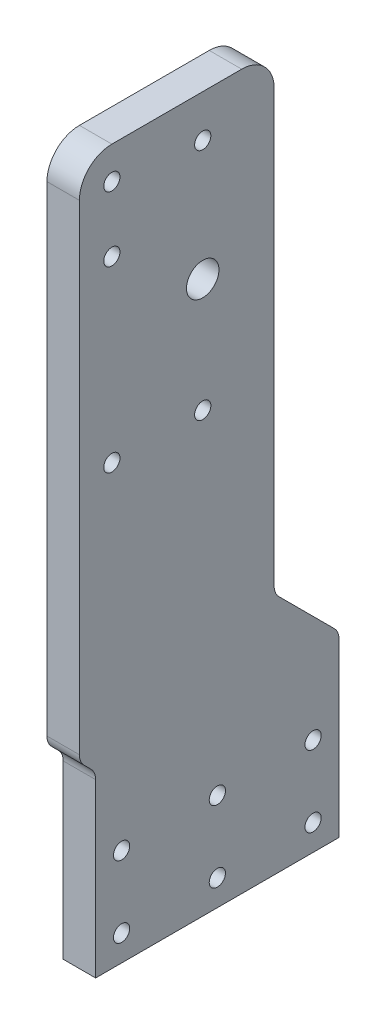
ISO-10303-21;
HEADER;
FILE_DESCRIPTION(('STEP AP214'),'2;1');
FILE_NAME('part.step','',(''),(''),'','','');
FILE_SCHEMA(('AUTOMOTIVE_DESIGN { 1 0 10303 214 1 1 1 1 }'));
ENDSEC;
DATA;
#1=APPLICATION_CONTEXT('core data for automotive mechanical design processes');
#2=APPLICATION_PROTOCOL_DEFINITION('international standard','automotive_design',2000,#1);
#3=PRODUCT_CONTEXT('',#1,'mechanical');
#4=PRODUCT('Part','Part','',(#3));
#5=PRODUCT_RELATED_PRODUCT_CATEGORY('part','',(#4));
#6=PRODUCT_DEFINITION_FORMATION('','',#4);
#7=PRODUCT_DEFINITION_CONTEXT('part definition',#1,'design');
#8=PRODUCT_DEFINITION('design','',#6,#7);
#9=PRODUCT_DEFINITION_SHAPE('','',#8);
#10=(LENGTH_UNIT() NAMED_UNIT(*) SI_UNIT(.MILLI.,.METRE.));
#11=(NAMED_UNIT(*) PLANE_ANGLE_UNIT() SI_UNIT($,.RADIAN.));
#12=(NAMED_UNIT(*) SI_UNIT($,.STERADIAN.) SOLID_ANGLE_UNIT());
#13=UNCERTAINTY_MEASURE_WITH_UNIT(LENGTH_MEASURE(1.E-05),#10,'distance_accuracy_value','');
#14=(GEOMETRIC_REPRESENTATION_CONTEXT(3) GLOBAL_UNCERTAINTY_ASSIGNED_CONTEXT((#13)) GLOBAL_UNIT_ASSIGNED_CONTEXT((#10,
#11,#12)) REPRESENTATION_CONTEXT('',''));
#15=CARTESIAN_POINT('',(0.,0.,0.));
#16=DIRECTION('',(0.,0.,1.));
#17=DIRECTION('',(1.,0.,0.));
#18=AXIS2_PLACEMENT_3D('',#15,#16,#17);
#19=CARTESIAN_POINT('',(10.,52.9289321881345,-70.));
#20=DIRECTION('',(1.,0.,0.));
#21=DIRECTION('',(0.,0.,-1.));
#22=AXIS2_PLACEMENT_3D('',#19,#20,#21);
#23=PLANE('',#22);
#24=CARTESIAN_POINT('',(10.,8.,-67.));
#25=DIRECTION('',(1.,0.,0.));
#26=DIRECTION('',(0.,0.,-1.));
#27=AXIS2_PLACEMENT_3D('',#24,#25,#26);
#28=CIRCLE('',#27,2.5);
#29=CARTESIAN_POINT('',(10.,8.,-69.5));
#30=VERTEX_POINT('',#29);
#31=EDGE_CURVE('E396',#30,#30,#28,.T.);
#32=ORIENTED_EDGE('',*,*,#31,.F.);
#33=EDGE_LOOP('',(#32));
#34=FACE_BOUND('',#33,.T.);
#35=CARTESIAN_POINT('',(10.,30.,-37.5));
#36=DIRECTION('',(1.,0.,0.));
#37=DIRECTION('',(0.,0.,-1.));
#38=AXIS2_PLACEMENT_3D('',#35,#36,#37);
#39=CIRCLE('',#38,2.5);
#40=CARTESIAN_POINT('',(10.,30.,-40.));
#41=VERTEX_POINT('',#40);
#42=EDGE_CURVE('E412',#41,#41,#39,.T.);
#43=ORIENTED_EDGE('',*,*,#42,.F.);
#44=EDGE_LOOP('',(#43));
#45=FACE_BOUND('',#44,.T.);
#46=CARTESIAN_POINT('',(10.,8.,-8.));
#47=DIRECTION('',(1.,0.,0.));
#48=DIRECTION('',(0.,0.,-1.));
#49=AXIS2_PLACEMENT_3D('',#46,#47,#48);
#50=CIRCLE('',#49,2.5);
#51=CARTESIAN_POINT('',(10.,8.,-10.5));
#52=VERTEX_POINT('',#51);
#53=EDGE_CURVE('E428',#52,#52,#50,.T.);
#54=ORIENTED_EDGE('',*,*,#53,.F.);
#55=EDGE_LOOP('',(#54));
#56=FACE_BOUND('',#55,.T.);
#57=CARTESIAN_POINT('',(10.,135.,-33.));
#58=DIRECTION('',(1.,0.,0.));
#59=DIRECTION('',(0.,0.,-1.));
#60=AXIS2_PLACEMENT_3D('',#57,#58,#59);
#61=CIRCLE('',#60,2.5);
#62=CARTESIAN_POINT('',(10.,135.,-35.5));
#63=VERTEX_POINT('',#62);
#64=EDGE_CURVE('E444',#63,#63,#61,.T.);
#65=ORIENTED_EDGE('',*,*,#64,.F.);
#66=EDGE_LOOP('',(#65));
#67=FACE_BOUND('',#66,.T.);
#68=CARTESIAN_POINT('',(10.,207.,-33.));
#69=DIRECTION('',(1.,0.,0.));
#70=DIRECTION('',(0.,0.,-1.));
#71=AXIS2_PLACEMENT_3D('',#68,#69,#70);
#72=CIRCLE('',#71,2.5);
#73=CARTESIAN_POINT('',(10.,207.,-35.5));
#74=VERTEX_POINT('',#73);
#75=EDGE_CURVE('E460',#74,#74,#72,.T.);
#76=ORIENTED_EDGE('',*,*,#75,.F.);
#77=EDGE_LOOP('',(#76));
#78=FACE_BOUND('',#77,.T.);
#79=CARTESIAN_POINT('',(10.,210.,-4.99999999999998));
#80=DIRECTION('',(1.,0.,0.));
#81=DIRECTION('',(0.,0.,-1.));
#82=AXIS2_PLACEMENT_3D('',#79,#80,#81);
#83=CIRCLE('',#82,2.5);
#84=CARTESIAN_POINT('',(10.,210.,-7.49999999999998));
#85=VERTEX_POINT('',#84);
#86=EDGE_CURVE('E182',#85,#85,#83,.T.);
#87=ORIENTED_EDGE('',*,*,#86,.F.);
#88=EDGE_LOOP('',(#87));
#89=FACE_BOUND('',#88,.T.);
#90=DIRECTION('',(0.,-1.,0.));
#91=VECTOR('',#90,1.);
#92=CARTESIAN_POINT('',(10.,52.9289321881345,0.));
#93=LINE('',#92,#91);
#94=CARTESIAN_POINT('',(10.,52.9289321881345,0.));
#95=VERTEX_POINT('',#94);
#96=CARTESIAN_POINT('',(10.,0.,0.));
#97=VERTEX_POINT('',#96);
#98=EDGE_CURVE('E218',#95,#97,#93,.T.);
#99=ORIENTED_EDGE('',*,*,#98,.T.);
#100=DIRECTION('',(0.,0.,-1.));
#101=VECTOR('',#100,1.);
#102=CARTESIAN_POINT('',(10.,0.,0.));
#103=LINE('',#102,#101);
#104=CARTESIAN_POINT('',(10.,0.,-75.));
#105=VERTEX_POINT('',#104);
#106=EDGE_CURVE('E118',#97,#105,#103,.T.);
#107=ORIENTED_EDGE('',*,*,#106,.T.);
#108=DIRECTION('',(0.,1.,0.));
#109=VECTOR('',#108,1.);
#110=CARTESIAN_POINT('',(10.,0.,-75.));
#111=LINE('',#110,#109);
#112=CARTESIAN_POINT('',(10.,52.9289321881345,-75.));
#113=VERTEX_POINT('',#112);
#114=EDGE_CURVE('E263',#105,#113,#111,.T.);
#115=ORIENTED_EDGE('',*,*,#114,.T.);
#116=CARTESIAN_POINT('',(10.,52.9289321881345,-70.));
#117=DIRECTION('',(1.,0.,0.));
#118=DIRECTION('',(0.,0.,-1.));
#119=AXIS2_PLACEMENT_3D('',#116,#117,#118);
#120=CIRCLE('',#119,5.00000000000001);
#121=CARTESIAN_POINT('',(10.,56.4644660940673,-73.5355339059327));
#122=VERTEX_POINT('',#121);
#123=EDGE_CURVE('E283',#113,#122,#120,.T.);
#124=ORIENTED_EDGE('',*,*,#123,.T.);
#125=DIRECTION('',(0.,0.707106781186547,0.707106781186548));
#126=VECTOR('',#125,1.);
#127=CARTESIAN_POINT('',(10.,56.4644660940673,-73.5355339059327));
#128=LINE('',#127,#126);
#129=CARTESIAN_POINT('',(10.,73.5355339059327,-56.4644660940673));
#130=VERTEX_POINT('',#129);
#131=EDGE_CURVE('E279',#122,#130,#128,.T.);
#132=ORIENTED_EDGE('',*,*,#131,.T.);
#133=CARTESIAN_POINT('',(10.,77.0710678118655,-60.));
#134=DIRECTION('',(-1.,0.,0.));
#135=DIRECTION('',(0.,0.,1.));
#136=AXIS2_PLACEMENT_3D('',#133,#134,#135);
#137=CIRCLE('',#136,5.);
#138=CARTESIAN_POINT('',(10.,77.0710678118655,-55.));
#139=VERTEX_POINT('',#138);
#140=EDGE_CURVE('E282',#130,#139,#137,.T.);
#141=ORIENTED_EDGE('',*,*,#140,.T.);
#142=DIRECTION('',(0.,1.,0.));
#143=VECTOR('',#142,1.);
#144=CARTESIAN_POINT('',(10.,77.0710678118655,-55.));
#145=LINE('',#144,#143);
#146=CARTESIAN_POINT('',(10.,210.,-55.));
#147=VERTEX_POINT('',#146);
#148=EDGE_CURVE('E287',#139,#147,#145,.T.);
#149=ORIENTED_EDGE('',*,*,#148,.T.);
#150=CARTESIAN_POINT('',(10.,210.,-45.));
#151=DIRECTION('',(1.,0.,0.));
#152=DIRECTION('',(0.,0.,-1.));
#153=AXIS2_PLACEMENT_3D('',#150,#151,#152);
#154=CIRCLE('',#153,10.);
#155=CARTESIAN_POINT('',(10.,220.,-44.9999999999999));
#156=VERTEX_POINT('',#155);
#157=EDGE_CURVE('E294',#147,#156,#154,.T.);
#158=ORIENTED_EDGE('',*,*,#157,.T.);
#159=DIRECTION('',(0.,0.,1.));
#160=VECTOR('',#159,1.);
#161=CARTESIAN_POINT('',(10.,220.,-44.9999999999999));
#162=LINE('',#161,#160);
#163=CARTESIAN_POINT('',(10.,220.,-5.00000000000005));
#164=VERTEX_POINT('',#163);
#165=EDGE_CURVE('E297',#156,#164,#162,.T.);
#166=ORIENTED_EDGE('',*,*,#165,.T.);
#167=CARTESIAN_POINT('',(10.,210.,-4.99999999999998));
#168=DIRECTION('',(1.,0.,0.));
#169=DIRECTION('',(0.,0.,-1.));
#170=AXIS2_PLACEMENT_3D('',#167,#168,#169);
#171=CIRCLE('',#170,10.);
#172=CARTESIAN_POINT('',(10.,210.,5.00000000000003));
#173=VERTEX_POINT('',#172);
#174=EDGE_CURVE('E300',#164,#173,#171,.T.);
#175=ORIENTED_EDGE('',*,*,#174,.T.);
#176=DIRECTION('',(0.,-1.,0.));
#177=VECTOR('',#176,1.);
#178=CARTESIAN_POINT('',(10.,210.,5.00000000000002));
#179=LINE('',#178,#177);
#180=CARTESIAN_POINT('',(10.,62.0710678118655,5.));
#181=VERTEX_POINT('',#180);
#182=EDGE_CURVE('E155',#173,#181,#179,.T.);
#183=ORIENTED_EDGE('',*,*,#182,.T.);
#184=CARTESIAN_POINT('',(10.,62.0710678118655,0.));
#185=DIRECTION('',(1.,0.,0.));
#186=DIRECTION('',(0.,0.,1.));
#187=AXIS2_PLACEMENT_3D('',#184,#185,#186);
#188=CIRCLE('',#187,5.);
#189=CARTESIAN_POINT('',(10.,58.5355339059327,3.53553390593272));
#190=VERTEX_POINT('',#189);
#191=EDGE_CURVE('E149',#181,#190,#188,.T.);
#192=ORIENTED_EDGE('',*,*,#191,.T.);
#193=DIRECTION('',(0.,-0.707106781186547,-0.707106781186548));
#194=VECTOR('',#193,1.);
#195=CARTESIAN_POINT('',(10.,58.5355339059327,3.53553390593272));
#196=LINE('',#195,#194);
#197=CARTESIAN_POINT('',(10.,56.4644660940673,1.46446609406728));
#198=VERTEX_POINT('',#197);
#199=EDGE_CURVE('E153',#190,#198,#196,.T.);
#200=ORIENTED_EDGE('',*,*,#199,.T.);
#201=CARTESIAN_POINT('',(10.,52.9289321881345,5.));
#202=DIRECTION('',(-1.,0.,0.));
#203=DIRECTION('',(0.,0.,-1.));
#204=AXIS2_PLACEMENT_3D('',#201,#202,#203);
#205=CIRCLE('',#204,5.);
#206=EDGE_CURVE('E57',#198,#95,#205,.T.);
#207=ORIENTED_EDGE('',*,*,#206,.T.);
#208=EDGE_LOOP('',(#99,#107,#115,#124,#132,#141,#149,#158,#166,#175,#183,#192,#200,#207));
#209=FACE_BOUND('',#208,.T.);
#210=CARTESIAN_POINT('',(10.,190.,-4.99999999999998));
#211=DIRECTION('',(1.,0.,0.));
#212=DIRECTION('',(0.,0.,-1.));
#213=AXIS2_PLACEMENT_3D('',#210,#211,#212);
#214=CIRCLE('',#213,2.5);
#215=CARTESIAN_POINT('',(10.,190.,-7.49999999999998));
#216=VERTEX_POINT('',#215);
#217=EDGE_CURVE('E468',#216,#216,#214,.T.);
#218=ORIENTED_EDGE('',*,*,#217,.F.);
#219=EDGE_LOOP('',(#218));
#220=FACE_BOUND('',#219,.T.);
#221=CARTESIAN_POINT('',(10.,135.,-4.99999999999998));
#222=DIRECTION('',(1.,0.,0.));
#223=DIRECTION('',(0.,0.,-1.));
#224=AXIS2_PLACEMENT_3D('',#221,#222,#223);
#225=CIRCLE('',#224,2.5);
#226=CARTESIAN_POINT('',(10.,135.,-7.49999999999998));
#227=VERTEX_POINT('',#226);
#228=EDGE_CURVE('E452',#227,#227,#225,.T.);
#229=ORIENTED_EDGE('',*,*,#228,.F.);
#230=EDGE_LOOP('',(#229));
#231=FACE_BOUND('',#230,.T.);
#232=CARTESIAN_POINT('',(10.,30.,-8.));
#233=DIRECTION('',(1.,0.,0.));
#234=DIRECTION('',(0.,0.,-1.));
#235=AXIS2_PLACEMENT_3D('',#232,#233,#234);
#236=CIRCLE('',#235,2.5);
#237=CARTESIAN_POINT('',(10.,30.,-10.5));
#238=VERTEX_POINT('',#237);
#239=EDGE_CURVE('E436',#238,#238,#236,.T.);
#240=ORIENTED_EDGE('',*,*,#239,.F.);
#241=EDGE_LOOP('',(#240));
#242=FACE_BOUND('',#241,.T.);
#243=CARTESIAN_POINT('',(10.,8.,-37.5));
#244=DIRECTION('',(1.,0.,0.));
#245=DIRECTION('',(0.,0.,-1.));
#246=AXIS2_PLACEMENT_3D('',#243,#244,#245);
#247=CIRCLE('',#246,2.5);
#248=CARTESIAN_POINT('',(10.,8.,-40.));
#249=VERTEX_POINT('',#248);
#250=EDGE_CURVE('E420',#249,#249,#247,.T.);
#251=ORIENTED_EDGE('',*,*,#250,.F.);
#252=EDGE_LOOP('',(#251));
#253=FACE_BOUND('',#252,.T.);
#254=CARTESIAN_POINT('',(10.,30.,-67.));
#255=DIRECTION('',(1.,0.,0.));
#256=DIRECTION('',(0.,0.,-1.));
#257=AXIS2_PLACEMENT_3D('',#254,#255,#256);
#258=CIRCLE('',#257,2.5);
#259=CARTESIAN_POINT('',(10.,30.,-69.5));
#260=VERTEX_POINT('',#259);
#261=EDGE_CURVE('E404',#260,#260,#258,.T.);
#262=ORIENTED_EDGE('',*,*,#261,.F.);
#263=EDGE_LOOP('',(#262));
#264=FACE_BOUND('',#263,.T.);
#265=CARTESIAN_POINT('',(10.,170.,-33.));
#266=DIRECTION('',(1.,0.,0.));
#267=DIRECTION('',(0.,0.,-1.));
#268=AXIS2_PLACEMENT_3D('',#265,#266,#267);
#269=CIRCLE('',#268,5.);
#270=CARTESIAN_POINT('',(10.,170.,-38.));
#271=VERTEX_POINT('',#270);
#272=EDGE_CURVE('E385',#271,#271,#269,.T.);
#273=ORIENTED_EDGE('',*,*,#272,.F.);
#274=EDGE_LOOP('',(#273));
#275=FACE_BOUND('',#274,.T.);
#276=ADVANCED_FACE('F39',(#34,#45,#56,#67,#78,#89,#209,#220,#231,#242,#253,#264,#275),#23,.T.);
#277=CARTESIAN_POINT('',(0.,52.9289321881345,-70.));
#278=DIRECTION('',(1.,0.,0.));
#279=DIRECTION('',(0.,0.,-1.));
#280=AXIS2_PLACEMENT_3D('',#277,#278,#279);
#281=PLANE('',#280);
#282=DIRECTION('',(0.,-1.,0.));
#283=VECTOR('',#282,1.);
#284=CARTESIAN_POINT('',(0.,52.9289321881345,0.));
#285=LINE('',#284,#283);
#286=CARTESIAN_POINT('',(0.,52.9289321881345,0.));
#287=VERTEX_POINT('',#286);
#288=CARTESIAN_POINT('',(0.,0.,0.));
#289=VERTEX_POINT('',#288);
#290=EDGE_CURVE('E177',#287,#289,#285,.T.);
#291=ORIENTED_EDGE('',*,*,#290,.F.);
#292=CARTESIAN_POINT('',(0.,52.9289321881345,5.));
#293=DIRECTION('',(-1.,0.,0.));
#294=DIRECTION('',(0.,0.,-1.));
#295=AXIS2_PLACEMENT_3D('',#292,#293,#294);
#296=CIRCLE('',#295,5.);
#297=CARTESIAN_POINT('',(0.,56.4644660940673,1.46446609406728));
#298=VERTEX_POINT('',#297);
#299=EDGE_CURVE('E110',#298,#287,#296,.T.);
#300=ORIENTED_EDGE('',*,*,#299,.F.);
#301=DIRECTION('',(0.,-0.707106781186547,-0.707106781186548));
#302=VECTOR('',#301,1.);
#303=CARTESIAN_POINT('',(0.,58.5355339059327,3.53553390593272));
#304=LINE('',#303,#302);
#305=CARTESIAN_POINT('',(0.,58.5355339059327,3.53553390593272));
#306=VERTEX_POINT('',#305);
#307=EDGE_CURVE('E104',#306,#298,#304,.T.);
#308=ORIENTED_EDGE('',*,*,#307,.F.);
#309=CARTESIAN_POINT('',(0.,62.0710678118655,0.));
#310=DIRECTION('',(1.,0.,0.));
#311=DIRECTION('',(0.,0.,1.));
#312=AXIS2_PLACEMENT_3D('',#309,#310,#311);
#313=CIRCLE('',#312,5.);
#314=CARTESIAN_POINT('',(0.,62.0710678118655,5.));
#315=VERTEX_POINT('',#314);
#316=EDGE_CURVE('E164',#315,#306,#313,.T.);
#317=ORIENTED_EDGE('',*,*,#316,.F.);
#318=DIRECTION('',(0.,-1.,0.));
#319=VECTOR('',#318,1.);
#320=CARTESIAN_POINT('',(0.,210.,5.00000000000002));
#321=LINE('',#320,#319);
#322=CARTESIAN_POINT('',(0.,210.,5.00000000000003));
#323=VERTEX_POINT('',#322);
#324=EDGE_CURVE('E209',#323,#315,#321,.T.);
#325=ORIENTED_EDGE('',*,*,#324,.F.);
#326=CARTESIAN_POINT('',(0.,210.,-4.99999999999998));
#327=DIRECTION('',(1.,0.,0.));
#328=DIRECTION('',(0.,0.,-1.));
#329=AXIS2_PLACEMENT_3D('',#326,#327,#328);
#330=CIRCLE('',#329,10.);
#331=CARTESIAN_POINT('',(0.,220.,-5.00000000000005));
#332=VERTEX_POINT('',#331);
#333=EDGE_CURVE('E206',#332,#323,#330,.T.);
#334=ORIENTED_EDGE('',*,*,#333,.F.);
#335=DIRECTION('',(0.,0.,1.));
#336=VECTOR('',#335,1.);
#337=CARTESIAN_POINT('',(0.,220.,-44.9999999999999));
#338=LINE('',#337,#336);
#339=CARTESIAN_POINT('',(0.,220.,-44.9999999999999));
#340=VERTEX_POINT('',#339);
#341=EDGE_CURVE('E203',#340,#332,#338,.T.);
#342=ORIENTED_EDGE('',*,*,#341,.F.);
#343=CARTESIAN_POINT('',(0.,210.,-45.));
#344=DIRECTION('',(1.,0.,0.));
#345=DIRECTION('',(0.,0.,-1.));
#346=AXIS2_PLACEMENT_3D('',#343,#344,#345);
#347=CIRCLE('',#346,10.);
#348=CARTESIAN_POINT('',(0.,210.,-55.));
#349=VERTEX_POINT('',#348);
#350=EDGE_CURVE('E200',#349,#340,#347,.T.);
#351=ORIENTED_EDGE('',*,*,#350,.F.);
#352=DIRECTION('',(0.,1.,0.));
#353=VECTOR('',#352,1.);
#354=CARTESIAN_POINT('',(0.,77.0710678118655,-55.));
#355=LINE('',#354,#353);
#356=CARTESIAN_POINT('',(0.,77.0710678118655,-55.));
#357=VERTEX_POINT('',#356);
#358=EDGE_CURVE('E197',#357,#349,#355,.T.);
#359=ORIENTED_EDGE('',*,*,#358,.F.);
#360=CARTESIAN_POINT('',(0.,77.0710678118655,-60.));
#361=DIRECTION('',(-1.,0.,0.));
#362=DIRECTION('',(0.,0.,1.));
#363=AXIS2_PLACEMENT_3D('',#360,#361,#362);
#364=CIRCLE('',#363,5.);
#365=CARTESIAN_POINT('',(0.,73.5355339059327,-56.4644660940673));
#366=VERTEX_POINT('',#365);
#367=EDGE_CURVE('E194',#366,#357,#364,.T.);
#368=ORIENTED_EDGE('',*,*,#367,.F.);
#369=DIRECTION('',(0.,0.707106781186547,0.707106781186548));
#370=VECTOR('',#369,1.);
#371=CARTESIAN_POINT('',(0.,56.4644660940673,-73.5355339059327));
#372=LINE('',#371,#370);
#373=CARTESIAN_POINT('',(0.,56.4644660940673,-73.5355339059327));
#374=VERTEX_POINT('',#373);
#375=EDGE_CURVE('E191',#374,#366,#372,.T.);
#376=ORIENTED_EDGE('',*,*,#375,.F.);
#377=CARTESIAN_POINT('',(0.,52.9289321881345,-70.));
#378=DIRECTION('',(1.,0.,0.));
#379=DIRECTION('',(0.,0.,-1.));
#380=AXIS2_PLACEMENT_3D('',#377,#378,#379);
#381=CIRCLE('',#380,5.00000000000001);
#382=CARTESIAN_POINT('',(0.,52.9289321881345,-75.));
#383=VERTEX_POINT('',#382);
#384=EDGE_CURVE('E188',#383,#374,#381,.T.);
#385=ORIENTED_EDGE('',*,*,#384,.F.);
#386=DIRECTION('',(0.,1.,0.));
#387=VECTOR('',#386,1.);
#388=CARTESIAN_POINT('',(0.,0.,-75.));
#389=LINE('',#388,#387);
#390=CARTESIAN_POINT('',(0.,0.,-75.));
#391=VERTEX_POINT('',#390);
#392=EDGE_CURVE('E185',#391,#383,#389,.T.);
#393=ORIENTED_EDGE('',*,*,#392,.F.);
#394=DIRECTION('',(0.,0.,-1.));
#395=VECTOR('',#394,1.);
#396=CARTESIAN_POINT('',(0.,0.,0.));
#397=LINE('',#396,#395);
#398=EDGE_CURVE('E181',#289,#391,#397,.T.);
#399=ORIENTED_EDGE('',*,*,#398,.F.);
#400=EDGE_LOOP('',(#291,#300,#308,#317,#325,#334,#342,#351,#359,#368,#376,#385,#393,#399));
#401=FACE_BOUND('',#400,.T.);
#402=CARTESIAN_POINT('',(0.,210.,-4.99999999999998));
#403=DIRECTION('',(1.,0.,0.));
#404=DIRECTION('',(0.,0.,-1.));
#405=AXIS2_PLACEMENT_3D('',#402,#403,#404);
#406=CIRCLE('',#405,2.5);
#407=CARTESIAN_POINT('',(0.,210.,-7.49999999999998));
#408=VERTEX_POINT('',#407);
#409=EDGE_CURVE('E472',#408,#408,#406,.T.);
#410=ORIENTED_EDGE('',*,*,#409,.T.);
#411=EDGE_LOOP('',(#410));
#412=FACE_BOUND('',#411,.T.);
#413=CARTESIAN_POINT('',(0.,190.,-4.99999999999998));
#414=DIRECTION('',(1.,0.,0.));
#415=DIRECTION('',(0.,0.,-1.));
#416=AXIS2_PLACEMENT_3D('',#413,#414,#415);
#417=CIRCLE('',#416,2.5);
#418=CARTESIAN_POINT('',(0.,190.,-7.49999999999998));
#419=VERTEX_POINT('',#418);
#420=EDGE_CURVE('E464',#419,#419,#417,.T.);
#421=ORIENTED_EDGE('',*,*,#420,.T.);
#422=EDGE_LOOP('',(#421));
#423=FACE_BOUND('',#422,.T.);
#424=CARTESIAN_POINT('',(0.,207.,-33.));
#425=DIRECTION('',(1.,0.,0.));
#426=DIRECTION('',(0.,0.,-1.));
#427=AXIS2_PLACEMENT_3D('',#424,#425,#426);
#428=CIRCLE('',#427,2.5);
#429=CARTESIAN_POINT('',(0.,207.,-35.5));
#430=VERTEX_POINT('',#429);
#431=EDGE_CURVE('E456',#430,#430,#428,.T.);
#432=ORIENTED_EDGE('',*,*,#431,.T.);
#433=EDGE_LOOP('',(#432));
#434=FACE_BOUND('',#433,.T.);
#435=CARTESIAN_POINT('',(0.,135.,-4.99999999999998));
#436=DIRECTION('',(1.,0.,0.));
#437=DIRECTION('',(0.,0.,-1.));
#438=AXIS2_PLACEMENT_3D('',#435,#436,#437);
#439=CIRCLE('',#438,2.5);
#440=CARTESIAN_POINT('',(0.,135.,-7.49999999999998));
#441=VERTEX_POINT('',#440);
#442=EDGE_CURVE('E448',#441,#441,#439,.T.);
#443=ORIENTED_EDGE('',*,*,#442,.T.);
#444=EDGE_LOOP('',(#443));
#445=FACE_BOUND('',#444,.T.);
#446=CARTESIAN_POINT('',(0.,135.,-33.));
#447=DIRECTION('',(1.,0.,0.));
#448=DIRECTION('',(0.,0.,-1.));
#449=AXIS2_PLACEMENT_3D('',#446,#447,#448);
#450=CIRCLE('',#449,2.5);
#451=CARTESIAN_POINT('',(0.,135.,-35.5));
#452=VERTEX_POINT('',#451);
#453=EDGE_CURVE('E440',#452,#452,#450,.T.);
#454=ORIENTED_EDGE('',*,*,#453,.T.);
#455=EDGE_LOOP('',(#454));
#456=FACE_BOUND('',#455,.T.);
#457=CARTESIAN_POINT('',(0.,30.,-8.));
#458=DIRECTION('',(1.,0.,0.));
#459=DIRECTION('',(0.,0.,-1.));
#460=AXIS2_PLACEMENT_3D('',#457,#458,#459);
#461=CIRCLE('',#460,2.5);
#462=CARTESIAN_POINT('',(0.,30.,-10.5));
#463=VERTEX_POINT('',#462);
#464=EDGE_CURVE('E432',#463,#463,#461,.T.);
#465=ORIENTED_EDGE('',*,*,#464,.T.);
#466=EDGE_LOOP('',(#465));
#467=FACE_BOUND('',#466,.T.);
#468=CARTESIAN_POINT('',(0.,8.,-8.));
#469=DIRECTION('',(1.,0.,0.));
#470=DIRECTION('',(0.,0.,-1.));
#471=AXIS2_PLACEMENT_3D('',#468,#469,#470);
#472=CIRCLE('',#471,2.5);
#473=CARTESIAN_POINT('',(0.,8.,-10.5));
#474=VERTEX_POINT('',#473);
#475=EDGE_CURVE('E424',#474,#474,#472,.T.);
#476=ORIENTED_EDGE('',*,*,#475,.T.);
#477=EDGE_LOOP('',(#476));
#478=FACE_BOUND('',#477,.T.);
#479=CARTESIAN_POINT('',(0.,8.,-37.5));
#480=DIRECTION('',(1.,0.,0.));
#481=DIRECTION('',(0.,0.,-1.));
#482=AXIS2_PLACEMENT_3D('',#479,#480,#481);
#483=CIRCLE('',#482,2.5);
#484=CARTESIAN_POINT('',(0.,8.,-40.));
#485=VERTEX_POINT('',#484);
#486=EDGE_CURVE('E416',#485,#485,#483,.T.);
#487=ORIENTED_EDGE('',*,*,#486,.T.);
#488=EDGE_LOOP('',(#487));
#489=FACE_BOUND('',#488,.T.);
#490=CARTESIAN_POINT('',(0.,30.,-37.5));
#491=DIRECTION('',(1.,0.,0.));
#492=DIRECTION('',(0.,0.,-1.));
#493=AXIS2_PLACEMENT_3D('',#490,#491,#492);
#494=CIRCLE('',#493,2.5);
#495=CARTESIAN_POINT('',(0.,30.,-40.));
#496=VERTEX_POINT('',#495);
#497=EDGE_CURVE('E408',#496,#496,#494,.T.);
#498=ORIENTED_EDGE('',*,*,#497,.T.);
#499=EDGE_LOOP('',(#498));
#500=FACE_BOUND('',#499,.T.);
#501=CARTESIAN_POINT('',(0.,30.,-67.));
#502=DIRECTION('',(1.,0.,0.));
#503=DIRECTION('',(0.,0.,-1.));
#504=AXIS2_PLACEMENT_3D('',#501,#502,#503);
#505=CIRCLE('',#504,2.5);
#506=CARTESIAN_POINT('',(0.,30.,-69.5));
#507=VERTEX_POINT('',#506);
#508=EDGE_CURVE('E400',#507,#507,#505,.T.);
#509=ORIENTED_EDGE('',*,*,#508,.T.);
#510=EDGE_LOOP('',(#509));
#511=FACE_BOUND('',#510,.T.);
#512=CARTESIAN_POINT('',(0.,8.,-67.));
#513=DIRECTION('',(1.,0.,0.));
#514=DIRECTION('',(0.,0.,-1.));
#515=AXIS2_PLACEMENT_3D('',#512,#513,#514);
#516=CIRCLE('',#515,2.5);
#517=CARTESIAN_POINT('',(0.,8.,-69.5));
#518=VERTEX_POINT('',#517);
#519=EDGE_CURVE('E393',#518,#518,#516,.T.);
#520=ORIENTED_EDGE('',*,*,#519,.T.);
#521=EDGE_LOOP('',(#520));
#522=FACE_BOUND('',#521,.T.);
#523=CARTESIAN_POINT('',(0.,170.,-33.));
#524=DIRECTION('',(1.,0.,0.));
#525=DIRECTION('',(0.,0.,-1.));
#526=AXIS2_PLACEMENT_3D('',#523,#524,#525);
#527=CIRCLE('',#526,5.);
#528=CARTESIAN_POINT('',(0.,170.,-38.));
#529=VERTEX_POINT('',#528);
#530=EDGE_CURVE('E388',#529,#529,#527,.T.);
#531=ORIENTED_EDGE('',*,*,#530,.T.);
#532=EDGE_LOOP('',(#531));
#533=FACE_BOUND('',#532,.T.);
#534=ADVANCED_FACE('F267',(#401,#412,#423,#434,#445,#456,#467,#478,#489,#500,#511,#522,#533),
#281,.F.);
#535=CARTESIAN_POINT('',(10.,52.9289321881345,0.));
#536=DIRECTION('',(0.,0.,-1.));
#537=DIRECTION('',(-1.,0.,0.));
#538=AXIS2_PLACEMENT_3D('',#535,#536,#537);
#539=PLANE('',#538);
#540=ORIENTED_EDGE('',*,*,#290,.T.);
#541=DIRECTION('',(-1.,0.,0.));
#542=VECTOR('',#541,1.);
#543=CARTESIAN_POINT('',(10.,0.,0.));
#544=LINE('',#543,#542);
#545=EDGE_CURVE('E11',#97,#289,#544,.T.);
#546=ORIENTED_EDGE('',*,*,#545,.F.);
#547=ORIENTED_EDGE('',*,*,#98,.F.);
#548=DIRECTION('',(-1.,0.,0.));
#549=VECTOR('',#548,1.);
#550=CARTESIAN_POINT('',(10.,52.9289321881345,0.));
#551=LINE('',#550,#549);
#552=EDGE_CURVE('E173',#95,#287,#551,.T.);
#553=ORIENTED_EDGE('',*,*,#552,.T.);
#554=EDGE_LOOP('',(#540,#546,#547,#553));
#555=FACE_BOUND('',#554,.T.);
#556=ADVANCED_FACE('F41',(#555),#539,.F.);
#557=CARTESIAN_POINT('',(10.,0.,0.));
#558=DIRECTION('',(0.,1.,0.));
#559=DIRECTION('',(0.,0.,1.));
#560=AXIS2_PLACEMENT_3D('',#557,#558,#559);
#561=PLANE('',#560);
#562=ORIENTED_EDGE('',*,*,#398,.T.);
#563=DIRECTION('',(-1.,0.,0.));
#564=VECTOR('',#563,1.);
#565=CARTESIAN_POINT('',(10.,0.,-75.));
#566=LINE('',#565,#564);
#567=EDGE_CURVE('E49',#105,#391,#566,.T.);
#568=ORIENTED_EDGE('',*,*,#567,.F.);
#569=ORIENTED_EDGE('',*,*,#106,.F.);
#570=ORIENTED_EDGE('',*,*,#545,.T.);
#571=EDGE_LOOP('',(#562,#568,#569,#570));
#572=FACE_BOUND('',#571,.T.);
#573=ADVANCED_FACE('F680',(#572),#561,.F.);
#574=CARTESIAN_POINT('',(10.,0.,-75.));
#575=DIRECTION('',(0.,0.,1.));
#576=DIRECTION('',(1.,0.,0.));
#577=AXIS2_PLACEMENT_3D('',#574,#575,#576);
#578=PLANE('',#577);
#579=ORIENTED_EDGE('',*,*,#392,.T.);
#580=DIRECTION('',(-1.,0.,0.));
#581=VECTOR('',#580,1.);
#582=CARTESIAN_POINT('',(10.,52.9289321881345,-75.));
#583=LINE('',#582,#581);
#584=EDGE_CURVE('E253',#113,#383,#583,.T.);
#585=ORIENTED_EDGE('',*,*,#584,.F.);
#586=ORIENTED_EDGE('',*,*,#114,.F.);
#587=ORIENTED_EDGE('',*,*,#567,.T.);
#588=EDGE_LOOP('',(#579,#585,#586,#587));
#589=FACE_BOUND('',#588,.T.);
#590=ADVANCED_FACE('F261',(#589),#578,.F.);
#591=CARTESIAN_POINT('',(10.,52.9289321881345,-70.));
#592=DIRECTION('',(-1.,0.,0.));
#593=DIRECTION('',(0.,0.,1.));
#594=AXIS2_PLACEMENT_3D('',#591,#592,#593);
#595=CYLINDRICAL_SURFACE('',#594,5.00000000000001);
#596=ORIENTED_EDGE('',*,*,#384,.T.);
#597=DIRECTION('',(-1.,0.,0.));
#598=VECTOR('',#597,1.);
#599=CARTESIAN_POINT('',(10.,56.4644660940673,-73.5355339059327));
#600=LINE('',#599,#598);
#601=EDGE_CURVE('E249',#122,#374,#600,.T.);
#602=ORIENTED_EDGE('',*,*,#601,.F.);
#603=ORIENTED_EDGE('',*,*,#123,.F.);
#604=ORIENTED_EDGE('',*,*,#584,.T.);
#605=EDGE_LOOP('',(#596,#602,#603,#604));
#606=FACE_BOUND('',#605,.T.);
#607=ADVANCED_FACE('F273',(#606),#595,.T.);
#608=CARTESIAN_POINT('',(10.,56.4644660940673,-73.5355339059327));
#609=DIRECTION('',(0.,-0.707106781186548,0.707106781186547));
#610=DIRECTION('',(0.,-0.707106781186547,-0.707106781186548));
#611=AXIS2_PLACEMENT_3D('',#608,#609,#610);
#612=PLANE('',#611);
#613=ORIENTED_EDGE('',*,*,#375,.T.);
#614=DIRECTION('',(-1.,0.,0.));
#615=VECTOR('',#614,1.);
#616=CARTESIAN_POINT('',(10.,73.5355339059327,-56.4644660940673));
#617=LINE('',#616,#615);
#618=EDGE_CURVE('E245',#130,#366,#617,.T.);
#619=ORIENTED_EDGE('',*,*,#618,.F.);
#620=ORIENTED_EDGE('',*,*,#131,.F.);
#621=ORIENTED_EDGE('',*,*,#601,.T.);
#622=EDGE_LOOP('',(#613,#619,#620,#621));
#623=FACE_BOUND('',#622,.T.);
#624=ADVANCED_FACE('F277',(#623),#612,.F.);
#625=CARTESIAN_POINT('',(10.,77.0710678118655,-60.));
#626=DIRECTION('',(-1.,0.,0.));
#627=DIRECTION('',(0.,0.,1.));
#628=AXIS2_PLACEMENT_3D('',#625,#626,#627);
#629=CYLINDRICAL_SURFACE('',#628,5.);
#630=ORIENTED_EDGE('',*,*,#367,.T.);
#631=DIRECTION('',(-1.,0.,0.));
#632=VECTOR('',#631,1.);
#633=CARTESIAN_POINT('',(10.,77.0710678118655,-55.));
#634=LINE('',#633,#632);
#635=EDGE_CURVE('E241',#139,#357,#634,.T.);
#636=ORIENTED_EDGE('',*,*,#635,.F.);
#637=ORIENTED_EDGE('',*,*,#140,.F.);
#638=ORIENTED_EDGE('',*,*,#618,.T.);
#639=EDGE_LOOP('',(#630,#636,#637,#638));
#640=FACE_BOUND('',#639,.T.);
#641=ADVANCED_FACE('F645',(#640),#629,.F.);
#642=CARTESIAN_POINT('',(10.,77.0710678118655,-55.));
#643=DIRECTION('',(0.,0.,1.));
#644=DIRECTION('',(0.,-1.,0.));
#645=AXIS2_PLACEMENT_3D('',#642,#643,#644);
#646=PLANE('',#645);
#647=ORIENTED_EDGE('',*,*,#358,.T.);
#648=DIRECTION('',(-1.,0.,0.));
#649=VECTOR('',#648,1.);
#650=CARTESIAN_POINT('',(10.,210.,-55.));
#651=LINE('',#650,#649);
#652=EDGE_CURVE('E237',#147,#349,#651,.T.);
#653=ORIENTED_EDGE('',*,*,#652,.F.);
#654=ORIENTED_EDGE('',*,*,#148,.F.);
#655=ORIENTED_EDGE('',*,*,#635,.T.);
#656=EDGE_LOOP('',(#647,#653,#654,#655));
#657=FACE_BOUND('',#656,.T.);
#658=ADVANCED_FACE('F635',(#657),#646,.F.);
#659=CARTESIAN_POINT('',(10.,210.,-45.));
#660=DIRECTION('',(-1.,0.,0.));
#661=DIRECTION('',(0.,0.,1.));
#662=AXIS2_PLACEMENT_3D('',#659,#660,#661);
#663=CYLINDRICAL_SURFACE('',#662,10.);
#664=ORIENTED_EDGE('',*,*,#350,.T.);
#665=DIRECTION('',(-1.,0.,0.));
#666=VECTOR('',#665,1.);
#667=CARTESIAN_POINT('',(10.,220.,-44.9999999999999));
#668=LINE('',#667,#666);
#669=EDGE_CURVE('E233',#156,#340,#668,.T.);
#670=ORIENTED_EDGE('',*,*,#669,.F.);
#671=ORIENTED_EDGE('',*,*,#157,.F.);
#672=ORIENTED_EDGE('',*,*,#652,.T.);
#673=EDGE_LOOP('',(#664,#670,#671,#672));
#674=FACE_BOUND('',#673,.T.);
#675=ADVANCED_FACE('F625',(#674),#663,.T.);
#676=CARTESIAN_POINT('',(10.,220.,-44.9999999999999));
#677=DIRECTION('',(0.,-1.,0.));
#678=DIRECTION('',(0.,0.,-1.));
#679=AXIS2_PLACEMENT_3D('',#676,#677,#678);
#680=PLANE('',#679);
#681=ORIENTED_EDGE('',*,*,#341,.T.);
#682=DIRECTION('',(-1.,0.,0.));
#683=VECTOR('',#682,1.);
#684=CARTESIAN_POINT('',(10.,220.,-5.00000000000005));
#685=LINE('',#684,#683);
#686=EDGE_CURVE('E229',#164,#332,#685,.T.);
#687=ORIENTED_EDGE('',*,*,#686,.F.);
#688=ORIENTED_EDGE('',*,*,#165,.F.);
#689=ORIENTED_EDGE('',*,*,#669,.T.);
#690=EDGE_LOOP('',(#681,#687,#688,#689));
#691=FACE_BOUND('',#690,.T.);
#692=ADVANCED_FACE('F616',(#691),#680,.F.);
#693=CARTESIAN_POINT('',(10.,210.,-4.99999999999998));
#694=DIRECTION('',(-1.,0.,0.));
#695=DIRECTION('',(0.,0.,1.));
#696=AXIS2_PLACEMENT_3D('',#693,#694,#695);
#697=CYLINDRICAL_SURFACE('',#696,10.);
#698=ORIENTED_EDGE('',*,*,#333,.T.);
#699=DIRECTION('',(-1.,0.,0.));
#700=VECTOR('',#699,1.);
#701=CARTESIAN_POINT('',(10.,210.,5.00000000000003));
#702=LINE('',#701,#700);
#703=EDGE_CURVE('E225',#173,#323,#702,.T.);
#704=ORIENTED_EDGE('',*,*,#703,.F.);
#705=ORIENTED_EDGE('',*,*,#174,.F.);
#706=ORIENTED_EDGE('',*,*,#686,.T.);
#707=EDGE_LOOP('',(#698,#704,#705,#706));
#708=FACE_BOUND('',#707,.T.);
#709=ADVANCED_FACE('F308',(#708),#697,.T.);
#710=CARTESIAN_POINT('',(10.,210.,5.00000000000002));
#711=DIRECTION('',(0.,0.,-1.));
#712=DIRECTION('',(0.,1.,0.));
#713=AXIS2_PLACEMENT_3D('',#710,#711,#712);
#714=PLANE('',#713);
#715=ORIENTED_EDGE('',*,*,#324,.T.);
#716=DIRECTION('',(-1.,0.,0.));
#717=VECTOR('',#716,1.);
#718=CARTESIAN_POINT('',(10.,62.0710678118655,5.));
#719=LINE('',#718,#717);
#720=EDGE_CURVE('E166',#181,#315,#719,.T.);
#721=ORIENTED_EDGE('',*,*,#720,.F.);
#722=ORIENTED_EDGE('',*,*,#182,.F.);
#723=ORIENTED_EDGE('',*,*,#703,.T.);
#724=EDGE_LOOP('',(#715,#721,#722,#723));
#725=FACE_BOUND('',#724,.T.);
#726=ADVANCED_FACE('F312',(#725),#714,.F.);
#727=CARTESIAN_POINT('',(10.,62.0710678118655,0.));
#728=DIRECTION('',(-1.,0.,0.));
#729=DIRECTION('',(0.,0.,1.));
#730=AXIS2_PLACEMENT_3D('',#727,#728,#729);
#731=CYLINDRICAL_SURFACE('',#730,5.);
#732=ORIENTED_EDGE('',*,*,#316,.T.);
#733=DIRECTION('',(-1.,0.,0.));
#734=VECTOR('',#733,1.);
#735=CARTESIAN_POINT('',(10.,58.5355339059327,3.53553390593272));
#736=LINE('',#735,#734);
#737=EDGE_CURVE('E161',#190,#306,#736,.T.);
#738=ORIENTED_EDGE('',*,*,#737,.F.);
#739=ORIENTED_EDGE('',*,*,#191,.F.);
#740=ORIENTED_EDGE('',*,*,#720,.T.);
#741=EDGE_LOOP('',(#732,#738,#739,#740));
#742=FACE_BOUND('',#741,.T.);
#743=ADVANCED_FACE('F162',(#742),#731,.T.);
#744=CARTESIAN_POINT('',(10.,58.5355339059327,3.53553390593272));
#745=DIRECTION('',(0.,0.707106781186548,-0.707106781186547));
#746=DIRECTION('',(0.,0.707106781186547,0.707106781186548));
#747=AXIS2_PLACEMENT_3D('',#744,#745,#746);
#748=PLANE('',#747);
#749=ORIENTED_EDGE('',*,*,#307,.T.);
#750=DIRECTION('',(-1.,0.,0.));
#751=VECTOR('',#750,1.);
#752=CARTESIAN_POINT('',(10.,56.4644660940673,1.46446609406728));
#753=LINE('',#752,#751);
#754=EDGE_CURVE('E167',#198,#298,#753,.T.);
#755=ORIENTED_EDGE('',*,*,#754,.F.);
#756=ORIENTED_EDGE('',*,*,#199,.F.);
#757=ORIENTED_EDGE('',*,*,#737,.T.);
#758=EDGE_LOOP('',(#749,#755,#756,#757));
#759=FACE_BOUND('',#758,.T.);
#760=ADVANCED_FACE('F169',(#759),#748,.F.);
#761=CARTESIAN_POINT('',(10.,52.9289321881345,5.));
#762=DIRECTION('',(-1.,0.,0.));
#763=DIRECTION('',(0.,0.,1.));
#764=AXIS2_PLACEMENT_3D('',#761,#762,#763);
#765=CYLINDRICAL_SURFACE('',#764,5.);
#766=ORIENTED_EDGE('',*,*,#299,.T.);
#767=ORIENTED_EDGE('',*,*,#552,.F.);
#768=ORIENTED_EDGE('',*,*,#206,.F.);
#769=ORIENTED_EDGE('',*,*,#754,.T.);
#770=EDGE_LOOP('',(#766,#767,#768,#769));
#771=FACE_BOUND('',#770,.T.);
#772=ADVANCED_FACE('F316',(#771),#765,.F.);
#773=CARTESIAN_POINT('',(10.,210.,-4.99999999999998));
#774=DIRECTION('',(-1.,0.,0.));
#775=DIRECTION('',(0.,0.,1.));
#776=AXIS2_PLACEMENT_3D('',#773,#774,#775);
#777=CYLINDRICAL_SURFACE('',#776,2.5);
#778=ORIENTED_EDGE('',*,*,#86,.T.);
#779=EDGE_LOOP('',(#778));
#780=FACE_BOUND('',#779,.T.);
#781=ORIENTED_EDGE('',*,*,#409,.F.);
#782=EDGE_LOOP('',(#781));
#783=FACE_BOUND('',#782,.T.);
#784=ADVANCED_FACE('F318',(#780,#783),#777,.F.);
#785=CARTESIAN_POINT('',(10.,190.,-4.99999999999998));
#786=DIRECTION('',(-1.,0.,0.));
#787=DIRECTION('',(0.,0.,1.));
#788=AXIS2_PLACEMENT_3D('',#785,#786,#787);
#789=CYLINDRICAL_SURFACE('',#788,2.5);
#790=ORIENTED_EDGE('',*,*,#217,.T.);
#791=EDGE_LOOP('',(#790));
#792=FACE_BOUND('',#791,.T.);
#793=ORIENTED_EDGE('',*,*,#420,.F.);
#794=EDGE_LOOP('',(#793));
#795=FACE_BOUND('',#794,.T.);
#796=ADVANCED_FACE('F324',(#792,#795),#789,.F.);
#797=CARTESIAN_POINT('',(10.,207.,-33.));
#798=DIRECTION('',(-1.,0.,0.));
#799=DIRECTION('',(0.,0.,1.));
#800=AXIS2_PLACEMENT_3D('',#797,#798,#799);
#801=CYLINDRICAL_SURFACE('',#800,2.5);
#802=ORIENTED_EDGE('',*,*,#75,.T.);
#803=EDGE_LOOP('',(#802));
#804=FACE_BOUND('',#803,.T.);
#805=ORIENTED_EDGE('',*,*,#431,.F.);
#806=EDGE_LOOP('',(#805));
#807=FACE_BOUND('',#806,.T.);
#808=ADVANCED_FACE('F340',(#804,#807),#801,.F.);
#809=CARTESIAN_POINT('',(10.,135.,-4.99999999999998));
#810=DIRECTION('',(-1.,0.,0.));
#811=DIRECTION('',(0.,0.,1.));
#812=AXIS2_PLACEMENT_3D('',#809,#810,#811);
#813=CYLINDRICAL_SURFACE('',#812,2.5);
#814=ORIENTED_EDGE('',*,*,#228,.T.);
#815=EDGE_LOOP('',(#814));
#816=FACE_BOUND('',#815,.T.);
#817=ORIENTED_EDGE('',*,*,#442,.F.);
#818=EDGE_LOOP('',(#817));
#819=FACE_BOUND('',#818,.T.);
#820=ADVANCED_FACE('F344',(#816,#819),#813,.F.);
#821=CARTESIAN_POINT('',(10.,135.,-33.));
#822=DIRECTION('',(-1.,0.,0.));
#823=DIRECTION('',(0.,0.,1.));
#824=AXIS2_PLACEMENT_3D('',#821,#822,#823);
#825=CYLINDRICAL_SURFACE('',#824,2.5);
#826=ORIENTED_EDGE('',*,*,#64,.T.);
#827=EDGE_LOOP('',(#826));
#828=FACE_BOUND('',#827,.T.);
#829=ORIENTED_EDGE('',*,*,#453,.F.);
#830=EDGE_LOOP('',(#829));
#831=FACE_BOUND('',#830,.T.);
#832=ADVANCED_FACE('F348',(#828,#831),#825,.F.);
#833=CARTESIAN_POINT('',(10.,30.,-8.));
#834=DIRECTION('',(-1.,0.,0.));
#835=DIRECTION('',(0.,0.,1.));
#836=AXIS2_PLACEMENT_3D('',#833,#834,#835);
#837=CYLINDRICAL_SURFACE('',#836,2.5);
#838=ORIENTED_EDGE('',*,*,#239,.T.);
#839=EDGE_LOOP('',(#838));
#840=FACE_BOUND('',#839,.T.);
#841=ORIENTED_EDGE('',*,*,#464,.F.);
#842=EDGE_LOOP('',(#841));
#843=FACE_BOUND('',#842,.T.);
#844=ADVANCED_FACE('F352',(#840,#843),#837,.F.);
#845=CARTESIAN_POINT('',(10.,8.,-8.));
#846=DIRECTION('',(-1.,0.,0.));
#847=DIRECTION('',(0.,0.,1.));
#848=AXIS2_PLACEMENT_3D('',#845,#846,#847);
#849=CYLINDRICAL_SURFACE('',#848,2.5);
#850=ORIENTED_EDGE('',*,*,#53,.T.);
#851=EDGE_LOOP('',(#850));
#852=FACE_BOUND('',#851,.T.);
#853=ORIENTED_EDGE('',*,*,#475,.F.);
#854=EDGE_LOOP('',(#853));
#855=FACE_BOUND('',#854,.T.);
#856=ADVANCED_FACE('F356',(#852,#855),#849,.F.);
#857=CARTESIAN_POINT('',(10.,8.,-37.5));
#858=DIRECTION('',(-1.,0.,0.));
#859=DIRECTION('',(0.,0.,1.));
#860=AXIS2_PLACEMENT_3D('',#857,#858,#859);
#861=CYLINDRICAL_SURFACE('',#860,2.5);
#862=ORIENTED_EDGE('',*,*,#250,.T.);
#863=EDGE_LOOP('',(#862));
#864=FACE_BOUND('',#863,.T.);
#865=ORIENTED_EDGE('',*,*,#486,.F.);
#866=EDGE_LOOP('',(#865));
#867=FACE_BOUND('',#866,.T.);
#868=ADVANCED_FACE('F360',(#864,#867),#861,.F.);
#869=CARTESIAN_POINT('',(10.,30.,-37.5));
#870=DIRECTION('',(-1.,0.,0.));
#871=DIRECTION('',(0.,0.,1.));
#872=AXIS2_PLACEMENT_3D('',#869,#870,#871);
#873=CYLINDRICAL_SURFACE('',#872,2.5);
#874=ORIENTED_EDGE('',*,*,#42,.T.);
#875=EDGE_LOOP('',(#874));
#876=FACE_BOUND('',#875,.T.);
#877=ORIENTED_EDGE('',*,*,#497,.F.);
#878=EDGE_LOOP('',(#877));
#879=FACE_BOUND('',#878,.T.);
#880=ADVANCED_FACE('F364',(#876,#879),#873,.F.);
#881=CARTESIAN_POINT('',(10.,30.,-67.));
#882=DIRECTION('',(-1.,0.,0.));
#883=DIRECTION('',(0.,0.,1.));
#884=AXIS2_PLACEMENT_3D('',#881,#882,#883);
#885=CYLINDRICAL_SURFACE('',#884,2.5);
#886=ORIENTED_EDGE('',*,*,#261,.T.);
#887=EDGE_LOOP('',(#886));
#888=FACE_BOUND('',#887,.T.);
#889=ORIENTED_EDGE('',*,*,#508,.F.);
#890=EDGE_LOOP('',(#889));
#891=FACE_BOUND('',#890,.T.);
#892=ADVANCED_FACE('F368',(#888,#891),#885,.F.);
#893=CARTESIAN_POINT('',(10.,8.,-67.));
#894=DIRECTION('',(-1.,0.,0.));
#895=DIRECTION('',(0.,0.,1.));
#896=AXIS2_PLACEMENT_3D('',#893,#894,#895);
#897=CYLINDRICAL_SURFACE('',#896,2.5);
#898=ORIENTED_EDGE('',*,*,#31,.T.);
#899=EDGE_LOOP('',(#898));
#900=FACE_BOUND('',#899,.T.);
#901=ORIENTED_EDGE('',*,*,#519,.F.);
#902=EDGE_LOOP('',(#901));
#903=FACE_BOUND('',#902,.T.);
#904=ADVANCED_FACE('F372',(#900,#903),#897,.F.);
#905=CARTESIAN_POINT('',(10.,170.,-33.));
#906=DIRECTION('',(-1.,0.,0.));
#907=DIRECTION('',(0.,0.,1.));
#908=AXIS2_PLACEMENT_3D('',#905,#906,#907);
#909=CYLINDRICAL_SURFACE('',#908,5.);
#910=ORIENTED_EDGE('',*,*,#272,.T.);
#911=EDGE_LOOP('',(#910));
#912=FACE_BOUND('',#911,.T.);
#913=ORIENTED_EDGE('',*,*,#530,.F.);
#914=EDGE_LOOP('',(#913));
#915=FACE_BOUND('',#914,.T.);
#916=ADVANCED_FACE('F376',(#912,#915),#909,.F.);
#917=CLOSED_SHELL('',(#276,#534,#556,#573,#590,#607,#624,#641,#658,#675,#692,#709,#726,#743,
#760,#772,#784,#796,#808,#820,#832,#844,#856,#868,#880,#892,#904,#916));
#918=MANIFOLD_SOLID_BREP('B2',#917);
#919=ADVANCED_BREP_SHAPE_REPRESENTATION('',(#18,#918),#14);
#920=SHAPE_DEFINITION_REPRESENTATION(#9,#919);
ENDSEC;
END-ISO-10303-21;
